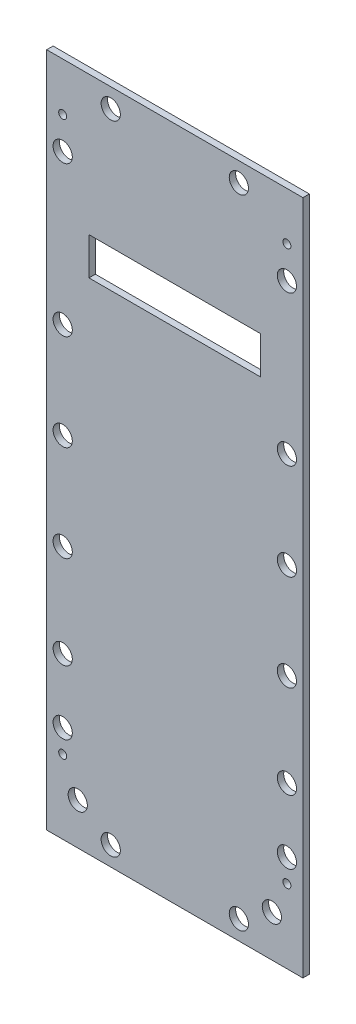
ISO-10303-21;
HEADER;
FILE_DESCRIPTION(('STEP AP214'),'2;1');
FILE_NAME('part.step','',(''),(''),'','','');
FILE_SCHEMA(('AUTOMOTIVE_DESIGN { 1 0 10303 214 1 1 1 1 }'));
ENDSEC;
DATA;
#1=APPLICATION_CONTEXT('core data for automotive mechanical design processes');
#2=APPLICATION_PROTOCOL_DEFINITION('international standard','automotive_design',2000,#1);
#3=PRODUCT_CONTEXT('',#1,'mechanical');
#4=PRODUCT('Part','Part','',(#3));
#5=PRODUCT_RELATED_PRODUCT_CATEGORY('part','',(#4));
#6=PRODUCT_DEFINITION_FORMATION('','',#4);
#7=PRODUCT_DEFINITION_CONTEXT('part definition',#1,'design');
#8=PRODUCT_DEFINITION('design','',#6,#7);
#9=PRODUCT_DEFINITION_SHAPE('','',#8);
#10=(LENGTH_UNIT() NAMED_UNIT(*) SI_UNIT(.MILLI.,.METRE.));
#11=(NAMED_UNIT(*) PLANE_ANGLE_UNIT() SI_UNIT($,.RADIAN.));
#12=(NAMED_UNIT(*) SI_UNIT($,.STERADIAN.) SOLID_ANGLE_UNIT());
#13=UNCERTAINTY_MEASURE_WITH_UNIT(LENGTH_MEASURE(1.E-05),#10,'distance_accuracy_value','');
#14=(GEOMETRIC_REPRESENTATION_CONTEXT(3) GLOBAL_UNCERTAINTY_ASSIGNED_CONTEXT((#13)) GLOBAL_UNIT_ASSIGNED_CONTEXT((#10,
#11,#12)) REPRESENTATION_CONTEXT('',''));
#15=CARTESIAN_POINT('',(0.,0.,0.));
#16=DIRECTION('',(0.,0.,1.));
#17=DIRECTION('',(1.,0.,0.));
#18=AXIS2_PLACEMENT_3D('',#15,#16,#17);
#19=CARTESIAN_POINT('',(0.,0.,2.));
#20=DIRECTION('',(0.,0.,-1.));
#21=DIRECTION('',(-1.,0.,0.));
#22=AXIS2_PLACEMENT_3D('',#19,#20,#21);
#23=PLANE('',#22);
#24=CARTESIAN_POINT('',(20.,205.,2.));
#25=DIRECTION('',(0.,0.,-1.));
#26=DIRECTION('',(-1.,0.,0.));
#27=AXIS2_PLACEMENT_3D('',#24,#25,#26);
#28=CIRCLE('',#27,3.);
#29=CARTESIAN_POINT('',(17.,205.,2.));
#30=VERTEX_POINT('',#29);
#31=EDGE_CURVE('E386',#30,#30,#28,.F.);
#32=ORIENTED_EDGE('',*,*,#31,.F.);
#33=EDGE_LOOP('',(#32));
#34=FACE_BOUND('',#33,.T.);
#35=CARTESIAN_POINT('',(5.00000000000001,30.2,2.));
#36=DIRECTION('',(0.,0.,-1.));
#37=DIRECTION('',(-1.,0.,0.));
#38=AXIS2_PLACEMENT_3D('',#35,#36,#37);
#39=CIRCLE('',#38,3.);
#40=CARTESIAN_POINT('',(2.00000000000001,30.2,2.));
#41=VERTEX_POINT('',#40);
#42=EDGE_CURVE('E385',#41,#41,#39,.F.);
#43=ORIENTED_EDGE('',*,*,#42,.F.);
#44=EDGE_LOOP('',(#43));
#45=FACE_BOUND('',#44,.T.);
#46=CARTESIAN_POINT('',(5.00000000000001,50.2,2.));
#47=DIRECTION('',(0.,0.,-1.));
#48=DIRECTION('',(-1.,0.,0.));
#49=AXIS2_PLACEMENT_3D('',#46,#47,#48);
#50=CIRCLE('',#49,3.);
#51=CARTESIAN_POINT('',(2.00000000000001,50.2,2.));
#52=VERTEX_POINT('',#51);
#53=EDGE_CURVE('E402',#52,#52,#50,.F.);
#54=ORIENTED_EDGE('',*,*,#53,.F.);
#55=EDGE_LOOP('',(#54));
#56=FACE_BOUND('',#55,.T.);
#57=CARTESIAN_POINT('',(5.00000000000002,79.2,2.));
#58=DIRECTION('',(0.,0.,-1.));
#59=DIRECTION('',(-1.,0.,0.));
#60=AXIS2_PLACEMENT_3D('',#57,#58,#59);
#61=CIRCLE('',#60,3.);
#62=CARTESIAN_POINT('',(2.00000000000001,79.2,2.));
#63=VERTEX_POINT('',#62);
#64=EDGE_CURVE('E401',#63,#63,#61,.F.);
#65=ORIENTED_EDGE('',*,*,#64,.F.);
#66=EDGE_LOOP('',(#65));
#67=FACE_BOUND('',#66,.T.);
#68=CARTESIAN_POINT('',(60.,5.99999999999999,2.));
#69=DIRECTION('',(0.,0.,-1.));
#70=DIRECTION('',(-1.,0.,0.));
#71=AXIS2_PLACEMENT_3D('',#68,#69,#70);
#72=CIRCLE('',#71,3.);
#73=CARTESIAN_POINT('',(57.,5.99999999999999,2.));
#74=VERTEX_POINT('',#73);
#75=EDGE_CURVE('E353',#74,#74,#72,.F.);
#76=ORIENTED_EDGE('',*,*,#75,.F.);
#77=EDGE_LOOP('',(#76));
#78=FACE_BOUND('',#77,.T.);
#79=CARTESIAN_POINT('',(20.,5.99999999999999,2.));
#80=DIRECTION('',(0.,0.,-1.));
#81=DIRECTION('',(-1.,0.,0.));
#82=AXIS2_PLACEMENT_3D('',#79,#80,#81);
#83=CIRCLE('',#82,2.99999999999999);
#84=CARTESIAN_POINT('',(17.,5.99999999999999,2.));
#85=VERTEX_POINT('',#84);
#86=EDGE_CURVE('E354',#85,#85,#83,.F.);
#87=ORIENTED_EDGE('',*,*,#86,.F.);
#88=EDGE_LOOP('',(#87));
#89=FACE_BOUND('',#88,.T.);
#90=CARTESIAN_POINT('',(70.3,13.,2.));
#91=DIRECTION('',(0.,0.,-1.));
#92=DIRECTION('',(-1.,0.,0.));
#93=AXIS2_PLACEMENT_3D('',#90,#91,#92);
#94=CIRCLE('',#93,3.00000000000001);
#95=CARTESIAN_POINT('',(67.3,13.,2.));
#96=VERTEX_POINT('',#95);
#97=EDGE_CURVE('E363',#96,#96,#94,.F.);
#98=ORIENTED_EDGE('',*,*,#97,.F.);
#99=EDGE_LOOP('',(#98));
#100=FACE_BOUND('',#99,.T.);
#101=CARTESIAN_POINT('',(60.,205.,2.));
#102=DIRECTION('',(0.,0.,-1.));
#103=DIRECTION('',(-1.,0.,0.));
#104=AXIS2_PLACEMENT_3D('',#101,#102,#103);
#105=CIRCLE('',#104,3.);
#106=CARTESIAN_POINT('',(57.,205.,2.));
#107=VERTEX_POINT('',#106);
#108=EDGE_CURVE('E371',#107,#107,#105,.F.);
#109=ORIENTED_EDGE('',*,*,#108,.F.);
#110=EDGE_LOOP('',(#109));
#111=FACE_BOUND('',#110,.T.);
#112=CARTESIAN_POINT('',(75.,139.2,2.));
#113=DIRECTION('',(0.,0.,-1.));
#114=DIRECTION('',(-1.,0.,0.));
#115=AXIS2_PLACEMENT_3D('',#112,#113,#114);
#116=CIRCLE('',#115,3.00000000000001);
#117=CARTESIAN_POINT('',(72.,139.2,2.));
#118=VERTEX_POINT('',#117);
#119=EDGE_CURVE('E449',#118,#118,#116,.F.);
#120=ORIENTED_EDGE('',*,*,#119,.F.);
#121=EDGE_LOOP('',(#120));
#122=FACE_BOUND('',#121,.T.);
#123=CARTESIAN_POINT('',(75.,109.2,2.));
#124=DIRECTION('',(0.,0.,-1.));
#125=DIRECTION('',(-1.,0.,0.));
#126=AXIS2_PLACEMENT_3D('',#123,#124,#125);
#127=CIRCLE('',#126,3.00000000000001);
#128=CARTESIAN_POINT('',(72.,109.2,2.));
#129=VERTEX_POINT('',#128);
#130=EDGE_CURVE('E450',#129,#129,#127,.F.);
#131=ORIENTED_EDGE('',*,*,#130,.F.);
#132=EDGE_LOOP('',(#131));
#133=FACE_BOUND('',#132,.T.);
#134=CARTESIAN_POINT('',(75.,79.2,2.));
#135=DIRECTION('',(0.,0.,-1.));
#136=DIRECTION('',(-1.,0.,0.));
#137=AXIS2_PLACEMENT_3D('',#134,#135,#136);
#138=CIRCLE('',#137,3.00000000000001);
#139=CARTESIAN_POINT('',(72.,79.2,2.));
#140=VERTEX_POINT('',#139);
#141=EDGE_CURVE('E459',#140,#140,#138,.F.);
#142=ORIENTED_EDGE('',*,*,#141,.F.);
#143=EDGE_LOOP('',(#142));
#144=FACE_BOUND('',#143,.T.);
#145=CARTESIAN_POINT('',(75.,50.2,2.));
#146=DIRECTION('',(0.,0.,-1.));
#147=DIRECTION('',(-1.,0.,0.));
#148=AXIS2_PLACEMENT_3D('',#145,#146,#147);
#149=CIRCLE('',#148,3.00000000000001);
#150=CARTESIAN_POINT('',(72.,50.2,2.));
#151=VERTEX_POINT('',#150);
#152=EDGE_CURVE('E467',#151,#151,#149,.F.);
#153=ORIENTED_EDGE('',*,*,#152,.F.);
#154=EDGE_LOOP('',(#153));
#155=FACE_BOUND('',#154,.T.);
#156=CARTESIAN_POINT('',(5.00000000000002,109.2,2.));
#157=DIRECTION('',(0.,0.,-1.));
#158=DIRECTION('',(-1.,0.,0.));
#159=AXIS2_PLACEMENT_3D('',#156,#157,#158);
#160=CIRCLE('',#159,3.);
#161=CARTESIAN_POINT('',(2.00000000000002,109.2,2.));
#162=VERTEX_POINT('',#161);
#163=EDGE_CURVE('E418',#162,#162,#160,.F.);
#164=ORIENTED_EDGE('',*,*,#163,.F.);
#165=EDGE_LOOP('',(#164));
#166=FACE_BOUND('',#165,.T.);
#167=CARTESIAN_POINT('',(5.00000000000002,139.2,2.));
#168=DIRECTION('',(0.,0.,-1.));
#169=DIRECTION('',(-1.,0.,0.));
#170=AXIS2_PLACEMENT_3D('',#167,#168,#169);
#171=CIRCLE('',#170,3.);
#172=CARTESIAN_POINT('',(2.00000000000002,139.2,2.));
#173=VERTEX_POINT('',#172);
#174=EDGE_CURVE('E417',#173,#173,#171,.F.);
#175=ORIENTED_EDGE('',*,*,#174,.F.);
#176=EDGE_LOOP('',(#175));
#177=FACE_BOUND('',#176,.T.);
#178=CARTESIAN_POINT('',(5.00000000000003,186.,2.));
#179=DIRECTION('',(0.,0.,-1.));
#180=DIRECTION('',(-1.,0.,0.));
#181=AXIS2_PLACEMENT_3D('',#178,#179,#180);
#182=CIRCLE('',#181,3.);
#183=CARTESIAN_POINT('',(2.00000000000003,186.,2.));
#184=VERTEX_POINT('',#183);
#185=EDGE_CURVE('E434',#184,#184,#182,.F.);
#186=ORIENTED_EDGE('',*,*,#185,.F.);
#187=EDGE_LOOP('',(#186));
#188=FACE_BOUND('',#187,.T.);
#189=CARTESIAN_POINT('',(75.,30.2,2.));
#190=DIRECTION('',(0.,0.,-1.));
#191=DIRECTION('',(-1.,0.,0.));
#192=AXIS2_PLACEMENT_3D('',#189,#190,#191);
#193=CIRCLE('',#192,3.00000000000001);
#194=CARTESIAN_POINT('',(72.,30.2,2.));
#195=VERTEX_POINT('',#194);
#196=EDGE_CURVE('E433',#195,#195,#193,.F.);
#197=ORIENTED_EDGE('',*,*,#196,.F.);
#198=EDGE_LOOP('',(#197));
#199=FACE_BOUND('',#198,.T.);
#200=CARTESIAN_POINT('',(9.7,13.,2.));
#201=DIRECTION('',(0.,0.,-1.));
#202=DIRECTION('',(-1.,0.,0.));
#203=AXIS2_PLACEMENT_3D('',#200,#201,#202);
#204=CIRCLE('',#203,3.);
#205=CARTESIAN_POINT('',(6.7,13.,2.));
#206=VERTEX_POINT('',#205);
#207=EDGE_CURVE('E338',#206,#206,#204,.F.);
#208=ORIENTED_EDGE('',*,*,#207,.F.);
#209=EDGE_LOOP('',(#208));
#210=FACE_BOUND('',#209,.T.);
#211=CARTESIAN_POINT('',(75.,186.,2.));
#212=DIRECTION('',(0.,0.,-1.));
#213=DIRECTION('',(-1.,0.,0.));
#214=AXIS2_PLACEMENT_3D('',#211,#212,#213);
#215=CIRCLE('',#214,3.00000000000001);
#216=CARTESIAN_POINT('',(72.,186.,2.));
#217=VERTEX_POINT('',#216);
#218=EDGE_CURVE('E480',#217,#217,#215,.F.);
#219=ORIENTED_EDGE('',*,*,#218,.F.);
#220=EDGE_LOOP('',(#219));
#221=FACE_BOUND('',#220,.T.);
#222=CARTESIAN_POINT('',(75.,196.,2.));
#223=DIRECTION('',(0.,0.,-1.));
#224=DIRECTION('',(-1.,0.,0.));
#225=AXIS2_PLACEMENT_3D('',#222,#223,#224);
#226=CIRCLE('',#225,1.25);
#227=CARTESIAN_POINT('',(73.75,196.,2.));
#228=VERTEX_POINT('',#227);
#229=EDGE_CURVE('E488',#228,#228,#226,.T.);
#230=ORIENTED_EDGE('',*,*,#229,.T.);
#231=EDGE_LOOP('',(#230));
#232=FACE_BOUND('',#231,.T.);
#233=CARTESIAN_POINT('',(5.00000000000003,196.,2.));
#234=DIRECTION('',(0.,0.,-1.));
#235=DIRECTION('',(-1.,0.,0.));
#236=AXIS2_PLACEMENT_3D('',#233,#234,#235);
#237=CIRCLE('',#236,1.25);
#238=CARTESIAN_POINT('',(3.75000000000003,196.,2.));
#239=VERTEX_POINT('',#238);
#240=EDGE_CURVE('E496',#239,#239,#237,.T.);
#241=ORIENTED_EDGE('',*,*,#240,.T.);
#242=EDGE_LOOP('',(#241));
#243=FACE_BOUND('',#242,.T.);
#244=CARTESIAN_POINT('',(75.,23.,2.));
#245=DIRECTION('',(0.,0.,-1.));
#246=DIRECTION('',(-1.,0.,0.));
#247=AXIS2_PLACEMENT_3D('',#244,#245,#246);
#248=CIRCLE('',#247,1.25);
#249=CARTESIAN_POINT('',(73.75,23.,2.));
#250=VERTEX_POINT('',#249);
#251=EDGE_CURVE('E504',#250,#250,#248,.T.);
#252=ORIENTED_EDGE('',*,*,#251,.T.);
#253=EDGE_LOOP('',(#252));
#254=FACE_BOUND('',#253,.T.);
#255=CARTESIAN_POINT('',(5.00000000000003,23.,2.));
#256=DIRECTION('',(0.,0.,-1.));
#257=DIRECTION('',(-1.,0.,0.));
#258=AXIS2_PLACEMENT_3D('',#255,#256,#257);
#259=CIRCLE('',#258,1.25);
#260=CARTESIAN_POINT('',(3.75000000000003,23.,2.));
#261=VERTEX_POINT('',#260);
#262=EDGE_CURVE('E139',#261,#261,#259,.T.);
#263=ORIENTED_EDGE('',*,*,#262,.T.);
#264=EDGE_LOOP('',(#263));
#265=FACE_BOUND('',#264,.T.);
#266=DIRECTION('',(1.,0.,0.));
#267=VECTOR('',#266,1.);
#268=CARTESIAN_POINT('',(80.,0.,2.));
#269=LINE('',#268,#267);
#270=CARTESIAN_POINT('',(0.,0.,2.));
#271=VERTEX_POINT('',#270);
#272=CARTESIAN_POINT('',(80.,0.,2.));
#273=VERTEX_POINT('',#272);
#274=EDGE_CURVE('E155',#271,#273,#269,.T.);
#275=ORIENTED_EDGE('',*,*,#274,.T.);
#276=DIRECTION('',(0.,1.,0.));
#277=VECTOR('',#276,1.);
#278=CARTESIAN_POINT('',(80.,211.,2.));
#279=LINE('',#278,#277);
#280=CARTESIAN_POINT('',(80.,211.,2.));
#281=VERTEX_POINT('',#280);
#282=EDGE_CURVE('E159',#273,#281,#279,.T.);
#283=ORIENTED_EDGE('',*,*,#282,.T.);
#284=DIRECTION('',(-1.,0.,0.));
#285=VECTOR('',#284,1.);
#286=CARTESIAN_POINT('',(0.,211.,2.));
#287=LINE('',#286,#285);
#288=CARTESIAN_POINT('',(0.,211.,2.));
#289=VERTEX_POINT('',#288);
#290=EDGE_CURVE('E163',#281,#289,#287,.T.);
#291=ORIENTED_EDGE('',*,*,#290,.T.);
#292=DIRECTION('',(0.,-1.,0.));
#293=VECTOR('',#292,1.);
#294=CARTESIAN_POINT('',(0.,0.,2.));
#295=LINE('',#294,#293);
#296=EDGE_CURVE('E166',#289,#271,#295,.T.);
#297=ORIENTED_EDGE('',*,*,#296,.T.);
#298=EDGE_LOOP('',(#275,#283,#291,#297));
#299=FACE_BOUND('',#298,.T.);
#300=DIRECTION('',(1.,0.,0.));
#301=VECTOR('',#300,1.);
#302=CARTESIAN_POINT('',(13.2,155.9,2.));
#303=LINE('',#302,#301);
#304=CARTESIAN_POINT('',(13.2,155.9,2.));
#305=VERTEX_POINT('',#304);
#306=CARTESIAN_POINT('',(66.8,155.9,2.));
#307=VERTEX_POINT('',#306);
#308=EDGE_CURVE('E105',#305,#307,#303,.T.);
#309=ORIENTED_EDGE('',*,*,#308,.F.);
#310=DIRECTION('',(0.,-1.,0.));
#311=VECTOR('',#310,1.);
#312=CARTESIAN_POINT('',(13.2,167.6,2.));
#313=LINE('',#312,#311);
#314=CARTESIAN_POINT('',(13.2,167.6,2.));
#315=VERTEX_POINT('',#314);
#316=EDGE_CURVE('E131',#315,#305,#313,.T.);
#317=ORIENTED_EDGE('',*,*,#316,.F.);
#318=DIRECTION('',(-1.,0.,0.));
#319=VECTOR('',#318,1.);
#320=CARTESIAN_POINT('',(66.8,167.6,2.));
#321=LINE('',#320,#319);
#322=CARTESIAN_POINT('',(66.8,167.6,2.));
#323=VERTEX_POINT('',#322);
#324=EDGE_CURVE('E127',#323,#315,#321,.T.);
#325=ORIENTED_EDGE('',*,*,#324,.F.);
#326=DIRECTION('',(0.,1.,0.));
#327=VECTOR('',#326,1.);
#328=CARTESIAN_POINT('',(66.8,167.6,2.));
#329=LINE('',#328,#327);
#330=EDGE_CURVE('E114',#307,#323,#329,.T.);
#331=ORIENTED_EDGE('',*,*,#330,.F.);
#332=EDGE_LOOP('',(#309,#317,#325,#331));
#333=FACE_BOUND('',#332,.T.);
#334=ADVANCED_FACE('F39',(#34,#45,#56,#67,#78,#89,#100,#111,#122,#133,#144,#155,#166,#177,#188,
#199,#210,#221,#232,#243,#254,#265,#299,#333),#23,.F.);
#335=CARTESIAN_POINT('',(0.,0.,0.));
#336=DIRECTION('',(0.,0.,-1.));
#337=DIRECTION('',(-1.,0.,0.));
#338=AXIS2_PLACEMENT_3D('',#335,#336,#337);
#339=PLANE('',#338);
#340=CARTESIAN_POINT('',(20.,205.,0.));
#341=DIRECTION('',(0.,0.,-1.));
#342=DIRECTION('',(-1.,0.,0.));
#343=AXIS2_PLACEMENT_3D('',#340,#341,#342);
#344=CIRCLE('',#343,3.);
#345=CARTESIAN_POINT('',(17.,205.,0.));
#346=VERTEX_POINT('',#345);
#347=EDGE_CURVE('E358',#346,#346,#344,.T.);
#348=ORIENTED_EDGE('',*,*,#347,.F.);
#349=EDGE_LOOP('',(#348));
#350=FACE_BOUND('',#349,.T.);
#351=CARTESIAN_POINT('',(5.00000000000001,30.2,0.));
#352=DIRECTION('',(0.,0.,-1.));
#353=DIRECTION('',(-1.,0.,0.));
#354=AXIS2_PLACEMENT_3D('',#351,#352,#353);
#355=CIRCLE('',#354,3.);
#356=CARTESIAN_POINT('',(2.00000000000001,30.2,0.));
#357=VERTEX_POINT('',#356);
#358=EDGE_CURVE('E381',#357,#357,#355,.T.);
#359=ORIENTED_EDGE('',*,*,#358,.F.);
#360=EDGE_LOOP('',(#359));
#361=FACE_BOUND('',#360,.T.);
#362=CARTESIAN_POINT('',(5.00000000000001,50.2,0.));
#363=DIRECTION('',(0.,0.,-1.));
#364=DIRECTION('',(-1.,0.,0.));
#365=AXIS2_PLACEMENT_3D('',#362,#363,#364);
#366=CIRCLE('',#365,3.);
#367=CARTESIAN_POINT('',(2.00000000000001,50.2,0.));
#368=VERTEX_POINT('',#367);
#369=EDGE_CURVE('E390',#368,#368,#366,.T.);
#370=ORIENTED_EDGE('',*,*,#369,.F.);
#371=EDGE_LOOP('',(#370));
#372=FACE_BOUND('',#371,.T.);
#373=CARTESIAN_POINT('',(5.00000000000002,79.2,0.));
#374=DIRECTION('',(0.,0.,-1.));
#375=DIRECTION('',(-1.,0.,0.));
#376=AXIS2_PLACEMENT_3D('',#373,#374,#375);
#377=CIRCLE('',#376,3.);
#378=CARTESIAN_POINT('',(2.00000000000001,79.2,0.));
#379=VERTEX_POINT('',#378);
#380=EDGE_CURVE('E397',#379,#379,#377,.T.);
#381=ORIENTED_EDGE('',*,*,#380,.F.);
#382=EDGE_LOOP('',(#381));
#383=FACE_BOUND('',#382,.T.);
#384=CARTESIAN_POINT('',(60.,5.99999999999999,0.));
#385=DIRECTION('',(0.,0.,-1.));
#386=DIRECTION('',(-1.,0.,0.));
#387=AXIS2_PLACEMENT_3D('',#384,#385,#386);
#388=CIRCLE('',#387,3.);
#389=CARTESIAN_POINT('',(57.,5.99999999999999,0.));
#390=VERTEX_POINT('',#389);
#391=EDGE_CURVE('E349',#390,#390,#388,.T.);
#392=ORIENTED_EDGE('',*,*,#391,.F.);
#393=EDGE_LOOP('',(#392));
#394=FACE_BOUND('',#393,.T.);
#395=CARTESIAN_POINT('',(20.,5.99999999999999,0.));
#396=DIRECTION('',(0.,0.,-1.));
#397=DIRECTION('',(-1.,0.,0.));
#398=AXIS2_PLACEMENT_3D('',#395,#396,#397);
#399=CIRCLE('',#398,2.99999999999999);
#400=CARTESIAN_POINT('',(17.,5.99999999999999,0.));
#401=VERTEX_POINT('',#400);
#402=EDGE_CURVE('E359',#401,#401,#399,.T.);
#403=ORIENTED_EDGE('',*,*,#402,.F.);
#404=EDGE_LOOP('',(#403));
#405=FACE_BOUND('',#404,.T.);
#406=CARTESIAN_POINT('',(70.3,13.,0.));
#407=DIRECTION('',(0.,0.,-1.));
#408=DIRECTION('',(-1.,0.,0.));
#409=AXIS2_PLACEMENT_3D('',#406,#407,#408);
#410=CIRCLE('',#409,3.00000000000001);
#411=CARTESIAN_POINT('',(67.3,13.,0.));
#412=VERTEX_POINT('',#411);
#413=EDGE_CURVE('E367',#412,#412,#410,.T.);
#414=ORIENTED_EDGE('',*,*,#413,.F.);
#415=EDGE_LOOP('',(#414));
#416=FACE_BOUND('',#415,.T.);
#417=CARTESIAN_POINT('',(60.,205.,0.));
#418=DIRECTION('',(0.,0.,-1.));
#419=DIRECTION('',(-1.,0.,0.));
#420=AXIS2_PLACEMENT_3D('',#417,#418,#419);
#421=CIRCLE('',#420,3.);
#422=CARTESIAN_POINT('',(57.,205.,0.));
#423=VERTEX_POINT('',#422);
#424=EDGE_CURVE('E346',#423,#423,#421,.T.);
#425=ORIENTED_EDGE('',*,*,#424,.F.);
#426=EDGE_LOOP('',(#425));
#427=FACE_BOUND('',#426,.T.);
#428=CARTESIAN_POINT('',(75.,139.2,0.));
#429=DIRECTION('',(0.,0.,-1.));
#430=DIRECTION('',(-1.,0.,0.));
#431=AXIS2_PLACEMENT_3D('',#428,#429,#430);
#432=CIRCLE('',#431,3.00000000000001);
#433=CARTESIAN_POINT('',(72.,139.2,0.));
#434=VERTEX_POINT('',#433);
#435=EDGE_CURVE('E445',#434,#434,#432,.T.);
#436=ORIENTED_EDGE('',*,*,#435,.F.);
#437=EDGE_LOOP('',(#436));
#438=FACE_BOUND('',#437,.T.);
#439=CARTESIAN_POINT('',(75.,109.2,0.));
#440=DIRECTION('',(0.,0.,-1.));
#441=DIRECTION('',(-1.,0.,0.));
#442=AXIS2_PLACEMENT_3D('',#439,#440,#441);
#443=CIRCLE('',#442,3.00000000000001);
#444=CARTESIAN_POINT('',(72.,109.2,0.));
#445=VERTEX_POINT('',#444);
#446=EDGE_CURVE('E455',#445,#445,#443,.T.);
#447=ORIENTED_EDGE('',*,*,#446,.F.);
#448=EDGE_LOOP('',(#447));
#449=FACE_BOUND('',#448,.T.);
#450=CARTESIAN_POINT('',(75.,79.2,0.));
#451=DIRECTION('',(0.,0.,-1.));
#452=DIRECTION('',(-1.,0.,0.));
#453=AXIS2_PLACEMENT_3D('',#450,#451,#452);
#454=CIRCLE('',#453,3.00000000000001);
#455=CARTESIAN_POINT('',(72.,79.2,0.));
#456=VERTEX_POINT('',#455);
#457=EDGE_CURVE('E463',#456,#456,#454,.T.);
#458=ORIENTED_EDGE('',*,*,#457,.F.);
#459=EDGE_LOOP('',(#458));
#460=FACE_BOUND('',#459,.T.);
#461=CARTESIAN_POINT('',(75.,50.2,0.));
#462=DIRECTION('',(0.,0.,-1.));
#463=DIRECTION('',(-1.,0.,0.));
#464=AXIS2_PLACEMENT_3D('',#461,#462,#463);
#465=CIRCLE('',#464,3.00000000000001);
#466=CARTESIAN_POINT('',(72.,50.2,0.));
#467=VERTEX_POINT('',#466);
#468=EDGE_CURVE('E438',#467,#467,#465,.T.);
#469=ORIENTED_EDGE('',*,*,#468,.F.);
#470=EDGE_LOOP('',(#469));
#471=FACE_BOUND('',#470,.T.);
#472=CARTESIAN_POINT('',(5.00000000000002,109.2,0.));
#473=DIRECTION('',(0.,0.,-1.));
#474=DIRECTION('',(-1.,0.,0.));
#475=AXIS2_PLACEMENT_3D('',#472,#473,#474);
#476=CIRCLE('',#475,3.);
#477=CARTESIAN_POINT('',(2.00000000000002,109.2,0.));
#478=VERTEX_POINT('',#477);
#479=EDGE_CURVE('E406',#478,#478,#476,.T.);
#480=ORIENTED_EDGE('',*,*,#479,.F.);
#481=EDGE_LOOP('',(#480));
#482=FACE_BOUND('',#481,.T.);
#483=CARTESIAN_POINT('',(5.00000000000002,139.2,0.));
#484=DIRECTION('',(0.,0.,-1.));
#485=DIRECTION('',(-1.,0.,0.));
#486=AXIS2_PLACEMENT_3D('',#483,#484,#485);
#487=CIRCLE('',#486,3.);
#488=CARTESIAN_POINT('',(2.00000000000002,139.2,0.));
#489=VERTEX_POINT('',#488);
#490=EDGE_CURVE('E413',#489,#489,#487,.T.);
#491=ORIENTED_EDGE('',*,*,#490,.F.);
#492=EDGE_LOOP('',(#491));
#493=FACE_BOUND('',#492,.T.);
#494=CARTESIAN_POINT('',(5.00000000000003,186.,0.));
#495=DIRECTION('',(0.,0.,-1.));
#496=DIRECTION('',(-1.,0.,0.));
#497=AXIS2_PLACEMENT_3D('',#494,#495,#496);
#498=CIRCLE('',#497,3.);
#499=CARTESIAN_POINT('',(2.00000000000003,186.,0.));
#500=VERTEX_POINT('',#499);
#501=EDGE_CURVE('E422',#500,#500,#498,.T.);
#502=ORIENTED_EDGE('',*,*,#501,.F.);
#503=EDGE_LOOP('',(#502));
#504=FACE_BOUND('',#503,.T.);
#505=CARTESIAN_POINT('',(75.,30.2,0.));
#506=DIRECTION('',(0.,0.,-1.));
#507=DIRECTION('',(-1.,0.,0.));
#508=AXIS2_PLACEMENT_3D('',#505,#506,#507);
#509=CIRCLE('',#508,3.00000000000001);
#510=CARTESIAN_POINT('',(72.,30.2,0.));
#511=VERTEX_POINT('',#510);
#512=EDGE_CURVE('E429',#511,#511,#509,.T.);
#513=ORIENTED_EDGE('',*,*,#512,.F.);
#514=EDGE_LOOP('',(#513));
#515=FACE_BOUND('',#514,.T.);
#516=CARTESIAN_POINT('',(9.7,13.,0.));
#517=DIRECTION('',(0.,0.,-1.));
#518=DIRECTION('',(-1.,0.,0.));
#519=AXIS2_PLACEMENT_3D('',#516,#517,#518);
#520=CIRCLE('',#519,3.);
#521=CARTESIAN_POINT('',(6.7,13.,0.));
#522=VERTEX_POINT('',#521);
#523=EDGE_CURVE('E341',#522,#522,#520,.T.);
#524=ORIENTED_EDGE('',*,*,#523,.F.);
#525=EDGE_LOOP('',(#524));
#526=FACE_BOUND('',#525,.T.);
#527=CARTESIAN_POINT('',(75.,186.,0.));
#528=DIRECTION('',(0.,0.,-1.));
#529=DIRECTION('',(-1.,0.,0.));
#530=AXIS2_PLACEMENT_3D('',#527,#528,#529);
#531=CIRCLE('',#530,3.00000000000001);
#532=CARTESIAN_POINT('',(72.,186.,0.));
#533=VERTEX_POINT('',#532);
#534=EDGE_CURVE('E454',#533,#533,#531,.T.);
#535=ORIENTED_EDGE('',*,*,#534,.F.);
#536=EDGE_LOOP('',(#535));
#537=FACE_BOUND('',#536,.T.);
#538=CARTESIAN_POINT('',(75.,196.,0.));
#539=DIRECTION('',(0.,0.,-1.));
#540=DIRECTION('',(-1.,0.,0.));
#541=AXIS2_PLACEMENT_3D('',#538,#539,#540);
#542=CIRCLE('',#541,1.25);
#543=CARTESIAN_POINT('',(73.75,196.,0.));
#544=VERTEX_POINT('',#543);
#545=EDGE_CURVE('E484',#544,#544,#542,.T.);
#546=ORIENTED_EDGE('',*,*,#545,.F.);
#547=EDGE_LOOP('',(#546));
#548=FACE_BOUND('',#547,.T.);
#549=CARTESIAN_POINT('',(5.00000000000003,196.,0.));
#550=DIRECTION('',(0.,0.,-1.));
#551=DIRECTION('',(-1.,0.,0.));
#552=AXIS2_PLACEMENT_3D('',#549,#550,#551);
#553=CIRCLE('',#552,1.25);
#554=CARTESIAN_POINT('',(3.75000000000003,196.,0.));
#555=VERTEX_POINT('',#554);
#556=EDGE_CURVE('E492',#555,#555,#553,.T.);
#557=ORIENTED_EDGE('',*,*,#556,.F.);
#558=EDGE_LOOP('',(#557));
#559=FACE_BOUND('',#558,.T.);
#560=CARTESIAN_POINT('',(75.,23.,0.));
#561=DIRECTION('',(0.,0.,-1.));
#562=DIRECTION('',(-1.,0.,0.));
#563=AXIS2_PLACEMENT_3D('',#560,#561,#562);
#564=CIRCLE('',#563,1.25);
#565=CARTESIAN_POINT('',(73.75,23.,0.));
#566=VERTEX_POINT('',#565);
#567=EDGE_CURVE('E500',#566,#566,#564,.T.);
#568=ORIENTED_EDGE('',*,*,#567,.F.);
#569=EDGE_LOOP('',(#568));
#570=FACE_BOUND('',#569,.T.);
#571=CARTESIAN_POINT('',(5.00000000000003,23.,0.));
#572=DIRECTION('',(0.,0.,-1.));
#573=DIRECTION('',(-1.,0.,0.));
#574=AXIS2_PLACEMENT_3D('',#571,#572,#573);
#575=CIRCLE('',#574,1.25);
#576=CARTESIAN_POINT('',(3.75000000000003,23.,0.));
#577=VERTEX_POINT('',#576);
#578=EDGE_CURVE('E508',#577,#577,#575,.T.);
#579=ORIENTED_EDGE('',*,*,#578,.F.);
#580=EDGE_LOOP('',(#579));
#581=FACE_BOUND('',#580,.T.);
#582=DIRECTION('',(1.,0.,0.));
#583=VECTOR('',#582,1.);
#584=CARTESIAN_POINT('',(80.,0.,0.));
#585=LINE('',#584,#583);
#586=CARTESIAN_POINT('',(0.,0.,0.));
#587=VERTEX_POINT('',#586);
#588=CARTESIAN_POINT('',(80.,0.,0.));
#589=VERTEX_POINT('',#588);
#590=EDGE_CURVE('E123',#587,#589,#585,.T.);
#591=ORIENTED_EDGE('',*,*,#590,.F.);
#592=DIRECTION('',(0.,-1.,0.));
#593=VECTOR('',#592,1.);
#594=CARTESIAN_POINT('',(0.,0.,0.));
#595=LINE('',#594,#593);
#596=CARTESIAN_POINT('',(0.,211.,0.));
#597=VERTEX_POINT('',#596);
#598=EDGE_CURVE('E160',#597,#587,#595,.T.);
#599=ORIENTED_EDGE('',*,*,#598,.F.);
#600=DIRECTION('',(-1.,0.,0.));
#601=VECTOR('',#600,1.);
#602=CARTESIAN_POINT('',(0.,211.,0.));
#603=LINE('',#602,#601);
#604=CARTESIAN_POINT('',(80.,211.,0.));
#605=VERTEX_POINT('',#604);
#606=EDGE_CURVE('E176',#605,#597,#603,.T.);
#607=ORIENTED_EDGE('',*,*,#606,.F.);
#608=DIRECTION('',(0.,1.,0.));
#609=VECTOR('',#608,1.);
#610=CARTESIAN_POINT('',(80.,211.,0.));
#611=LINE('',#610,#609);
#612=EDGE_CURVE('E173',#589,#605,#611,.T.);
#613=ORIENTED_EDGE('',*,*,#612,.F.);
#614=EDGE_LOOP('',(#591,#599,#607,#613));
#615=FACE_BOUND('',#614,.T.);
#616=DIRECTION('',(0.,-1.,0.));
#617=VECTOR('',#616,1.);
#618=CARTESIAN_POINT('',(13.2,167.6,0.));
#619=LINE('',#618,#617);
#620=CARTESIAN_POINT('',(13.2,167.6,0.));
#621=VERTEX_POINT('',#620);
#622=CARTESIAN_POINT('',(13.2,155.9,0.));
#623=VERTEX_POINT('',#622);
#624=EDGE_CURVE('E115',#621,#623,#619,.T.);
#625=ORIENTED_EDGE('',*,*,#624,.T.);
#626=DIRECTION('',(1.,0.,0.));
#627=VECTOR('',#626,1.);
#628=CARTESIAN_POINT('',(13.2,155.9,0.));
#629=LINE('',#628,#627);
#630=CARTESIAN_POINT('',(66.8,155.9,0.));
#631=VERTEX_POINT('',#630);
#632=EDGE_CURVE('E63',#623,#631,#629,.T.);
#633=ORIENTED_EDGE('',*,*,#632,.T.);
#634=DIRECTION('',(0.,1.,0.));
#635=VECTOR('',#634,1.);
#636=CARTESIAN_POINT('',(66.8,167.6,0.));
#637=LINE('',#636,#635);
#638=CARTESIAN_POINT('',(66.8,167.6,0.));
#639=VERTEX_POINT('',#638);
#640=EDGE_CURVE('E121',#631,#639,#637,.T.);
#641=ORIENTED_EDGE('',*,*,#640,.T.);
#642=DIRECTION('',(-1.,0.,0.));
#643=VECTOR('',#642,1.);
#644=CARTESIAN_POINT('',(66.8,167.6,0.));
#645=LINE('',#644,#643);
#646=EDGE_CURVE('E142',#639,#621,#645,.T.);
#647=ORIENTED_EDGE('',*,*,#646,.T.);
#648=EDGE_LOOP('',(#625,#633,#641,#647));
#649=FACE_BOUND('',#648,.T.);
#650=ADVANCED_FACE('F199',(#350,#361,#372,#383,#394,#405,#416,#427,#438,#449,#460,#471,#482,
#493,#504,#515,#526,#537,#548,#559,#570,#581,#615,#649),#339,.T.);
#651=CARTESIAN_POINT('',(80.,0.,2.));
#652=DIRECTION('',(0.,1.,0.));
#653=DIRECTION('',(0.,0.,1.));
#654=AXIS2_PLACEMENT_3D('',#651,#652,#653);
#655=PLANE('',#654);
#656=ORIENTED_EDGE('',*,*,#590,.T.);
#657=DIRECTION('',(0.,0.,-1.));
#658=VECTOR('',#657,1.);
#659=CARTESIAN_POINT('',(80.,0.,2.));
#660=LINE('',#659,#658);
#661=EDGE_CURVE('E11',#273,#589,#660,.T.);
#662=ORIENTED_EDGE('',*,*,#661,.F.);
#663=ORIENTED_EDGE('',*,*,#274,.F.);
#664=DIRECTION('',(0.,0.,-1.));
#665=VECTOR('',#664,1.);
#666=CARTESIAN_POINT('',(0.,0.,2.));
#667=LINE('',#666,#665);
#668=EDGE_CURVE('E169',#271,#587,#667,.T.);
#669=ORIENTED_EDGE('',*,*,#668,.T.);
#670=EDGE_LOOP('',(#656,#662,#663,#669));
#671=FACE_BOUND('',#670,.T.);
#672=ADVANCED_FACE('F41',(#671),#655,.F.);
#673=CARTESIAN_POINT('',(80.,211.,2.));
#674=DIRECTION('',(-1.,0.,0.));
#675=DIRECTION('',(0.,0.,1.));
#676=AXIS2_PLACEMENT_3D('',#673,#674,#675);
#677=PLANE('',#676);
#678=ORIENTED_EDGE('',*,*,#612,.T.);
#679=DIRECTION('',(0.,0.,-1.));
#680=VECTOR('',#679,1.);
#681=CARTESIAN_POINT('',(80.,211.,2.));
#682=LINE('',#681,#680);
#683=EDGE_CURVE('E48',#281,#605,#682,.T.);
#684=ORIENTED_EDGE('',*,*,#683,.F.);
#685=ORIENTED_EDGE('',*,*,#282,.F.);
#686=ORIENTED_EDGE('',*,*,#661,.T.);
#687=EDGE_LOOP('',(#678,#684,#685,#686));
#688=FACE_BOUND('',#687,.T.);
#689=ADVANCED_FACE('F209',(#688),#677,.F.);
#690=CARTESIAN_POINT('',(0.,211.,2.));
#691=DIRECTION('',(0.,-1.,0.));
#692=DIRECTION('',(0.,0.,-1.));
#693=AXIS2_PLACEMENT_3D('',#690,#691,#692);
#694=PLANE('',#693);
#695=ORIENTED_EDGE('',*,*,#606,.T.);
#696=DIRECTION('',(0.,0.,-1.));
#697=VECTOR('',#696,1.);
#698=CARTESIAN_POINT('',(0.,211.,2.));
#699=LINE('',#698,#697);
#700=EDGE_CURVE('E184',#289,#597,#699,.T.);
#701=ORIENTED_EDGE('',*,*,#700,.F.);
#702=ORIENTED_EDGE('',*,*,#290,.F.);
#703=ORIENTED_EDGE('',*,*,#683,.T.);
#704=EDGE_LOOP('',(#695,#701,#702,#703));
#705=FACE_BOUND('',#704,.T.);
#706=ADVANCED_FACE('F193',(#705),#694,.F.);
#707=CARTESIAN_POINT('',(0.,0.,2.));
#708=DIRECTION('',(1.,0.,0.));
#709=DIRECTION('',(0.,0.,-1.));
#710=AXIS2_PLACEMENT_3D('',#707,#708,#709);
#711=PLANE('',#710);
#712=ORIENTED_EDGE('',*,*,#598,.T.);
#713=ORIENTED_EDGE('',*,*,#668,.F.);
#714=ORIENTED_EDGE('',*,*,#296,.F.);
#715=ORIENTED_EDGE('',*,*,#700,.T.);
#716=EDGE_LOOP('',(#712,#713,#714,#715));
#717=FACE_BOUND('',#716,.T.);
#718=ADVANCED_FACE('F203',(#717),#711,.F.);
#719=CARTESIAN_POINT('',(13.2,155.9,2.));
#720=DIRECTION('',(0.,1.,0.));
#721=DIRECTION('',(0.,0.,1.));
#722=AXIS2_PLACEMENT_3D('',#719,#720,#721);
#723=PLANE('',#722);
#724=ORIENTED_EDGE('',*,*,#632,.F.);
#725=DIRECTION('',(0.,0.,-1.));
#726=VECTOR('',#725,1.);
#727=CARTESIAN_POINT('',(13.2,155.9,2.));
#728=LINE('',#727,#726);
#729=EDGE_CURVE('E109',#305,#623,#728,.T.);
#730=ORIENTED_EDGE('',*,*,#729,.F.);
#731=ORIENTED_EDGE('',*,*,#308,.T.);
#732=DIRECTION('',(0.,0.,-1.));
#733=VECTOR('',#732,1.);
#734=CARTESIAN_POINT('',(66.8,155.9,2.));
#735=LINE('',#734,#733);
#736=EDGE_CURVE('E108',#307,#631,#735,.T.);
#737=ORIENTED_EDGE('',*,*,#736,.T.);
#738=EDGE_LOOP('',(#724,#730,#731,#737));
#739=FACE_BOUND('',#738,.T.);
#740=ADVANCED_FACE('F107',(#739),#723,.T.);
#741=CARTESIAN_POINT('',(66.8,167.6,2.));
#742=DIRECTION('',(-1.,0.,0.));
#743=DIRECTION('',(0.,0.,1.));
#744=AXIS2_PLACEMENT_3D('',#741,#742,#743);
#745=PLANE('',#744);
#746=ORIENTED_EDGE('',*,*,#640,.F.);
#747=ORIENTED_EDGE('',*,*,#736,.F.);
#748=ORIENTED_EDGE('',*,*,#330,.T.);
#749=DIRECTION('',(0.,0.,-1.));
#750=VECTOR('',#749,1.);
#751=CARTESIAN_POINT('',(66.8,167.6,2.));
#752=LINE('',#751,#750);
#753=EDGE_CURVE('E124',#323,#639,#752,.T.);
#754=ORIENTED_EDGE('',*,*,#753,.T.);
#755=EDGE_LOOP('',(#746,#747,#748,#754));
#756=FACE_BOUND('',#755,.T.);
#757=ADVANCED_FACE('F118',(#756),#745,.T.);
#758=CARTESIAN_POINT('',(66.8,167.6,2.));
#759=DIRECTION('',(0.,-1.,0.));
#760=DIRECTION('',(0.,0.,-1.));
#761=AXIS2_PLACEMENT_3D('',#758,#759,#760);
#762=PLANE('',#761);
#763=ORIENTED_EDGE('',*,*,#646,.F.);
#764=ORIENTED_EDGE('',*,*,#753,.F.);
#765=ORIENTED_EDGE('',*,*,#324,.T.);
#766=DIRECTION('',(0.,0.,-1.));
#767=VECTOR('',#766,1.);
#768=CARTESIAN_POINT('',(13.2,167.6,2.));
#769=LINE('',#768,#767);
#770=EDGE_CURVE('E55',#315,#621,#769,.T.);
#771=ORIENTED_EDGE('',*,*,#770,.T.);
#772=EDGE_LOOP('',(#763,#764,#765,#771));
#773=FACE_BOUND('',#772,.T.);
#774=ADVANCED_FACE('F236',(#773),#762,.T.);
#775=CARTESIAN_POINT('',(13.2,167.6,2.));
#776=DIRECTION('',(1.,0.,0.));
#777=DIRECTION('',(0.,0.,-1.));
#778=AXIS2_PLACEMENT_3D('',#775,#776,#777);
#779=PLANE('',#778);
#780=ORIENTED_EDGE('',*,*,#624,.F.);
#781=ORIENTED_EDGE('',*,*,#770,.F.);
#782=ORIENTED_EDGE('',*,*,#316,.T.);
#783=ORIENTED_EDGE('',*,*,#729,.T.);
#784=EDGE_LOOP('',(#780,#781,#782,#783));
#785=FACE_BOUND('',#784,.T.);
#786=ADVANCED_FACE('F240',(#785),#779,.T.);
#787=CARTESIAN_POINT('',(5.00000000000003,23.,0.));
#788=DIRECTION('',(0.,0.,-1.));
#789=DIRECTION('',(-1.,0.,0.));
#790=AXIS2_PLACEMENT_3D('',#787,#788,#789);
#791=CYLINDRICAL_SURFACE('',#790,1.25);
#792=ORIENTED_EDGE('',*,*,#578,.T.);
#793=EDGE_LOOP('',(#792));
#794=FACE_BOUND('',#793,.T.);
#795=ORIENTED_EDGE('',*,*,#262,.F.);
#796=EDGE_LOOP('',(#795));
#797=FACE_BOUND('',#796,.T.);
#798=ADVANCED_FACE('F246',(#794,#797),#791,.F.);
#799=CARTESIAN_POINT('',(75.,23.,0.));
#800=DIRECTION('',(0.,0.,-1.));
#801=DIRECTION('',(-1.,0.,0.));
#802=AXIS2_PLACEMENT_3D('',#799,#800,#801);
#803=CYLINDRICAL_SURFACE('',#802,1.25);
#804=ORIENTED_EDGE('',*,*,#567,.T.);
#805=EDGE_LOOP('',(#804));
#806=FACE_BOUND('',#805,.T.);
#807=ORIENTED_EDGE('',*,*,#251,.F.);
#808=EDGE_LOOP('',(#807));
#809=FACE_BOUND('',#808,.T.);
#810=ADVANCED_FACE('F249',(#806,#809),#803,.F.);
#811=CARTESIAN_POINT('',(5.00000000000003,196.,0.));
#812=DIRECTION('',(0.,0.,-1.));
#813=DIRECTION('',(-1.,0.,0.));
#814=AXIS2_PLACEMENT_3D('',#811,#812,#813);
#815=CYLINDRICAL_SURFACE('',#814,1.25);
#816=ORIENTED_EDGE('',*,*,#556,.T.);
#817=EDGE_LOOP('',(#816));
#818=FACE_BOUND('',#817,.T.);
#819=ORIENTED_EDGE('',*,*,#240,.F.);
#820=EDGE_LOOP('',(#819));
#821=FACE_BOUND('',#820,.T.);
#822=ADVANCED_FACE('F253',(#818,#821),#815,.F.);
#823=CARTESIAN_POINT('',(75.,196.,0.));
#824=DIRECTION('',(0.,0.,-1.));
#825=DIRECTION('',(-1.,0.,0.));
#826=AXIS2_PLACEMENT_3D('',#823,#824,#825);
#827=CYLINDRICAL_SURFACE('',#826,1.25);
#828=ORIENTED_EDGE('',*,*,#545,.T.);
#829=EDGE_LOOP('',(#828));
#830=FACE_BOUND('',#829,.T.);
#831=ORIENTED_EDGE('',*,*,#229,.F.);
#832=EDGE_LOOP('',(#831));
#833=FACE_BOUND('',#832,.T.);
#834=ADVANCED_FACE('F257',(#830,#833),#827,.F.);
#835=CARTESIAN_POINT('',(75.,186.,10.4852813742386));
#836=DIRECTION('',(0.,0.,-1.));
#837=DIRECTION('',(-1.,0.,0.));
#838=AXIS2_PLACEMENT_3D('',#835,#836,#837);
#839=CYLINDRICAL_SURFACE('',#838,3.00000000000001);
#840=ORIENTED_EDGE('',*,*,#218,.T.);
#841=EDGE_LOOP('',(#840));
#842=FACE_BOUND('',#841,.T.);
#843=ORIENTED_EDGE('',*,*,#534,.T.);
#844=EDGE_LOOP('',(#843));
#845=FACE_BOUND('',#844,.T.);
#846=ADVANCED_FACE('F261',(#842,#845),#839,.F.);
#847=CARTESIAN_POINT('',(9.7,13.,10.4852813742386));
#848=DIRECTION('',(0.,0.,-1.));
#849=DIRECTION('',(-1.,0.,0.));
#850=AXIS2_PLACEMENT_3D('',#847,#848,#849);
#851=CYLINDRICAL_SURFACE('',#850,3.);
#852=ORIENTED_EDGE('',*,*,#207,.T.);
#853=EDGE_LOOP('',(#852));
#854=FACE_BOUND('',#853,.T.);
#855=ORIENTED_EDGE('',*,*,#523,.T.);
#856=EDGE_LOOP('',(#855));
#857=FACE_BOUND('',#856,.T.);
#858=ADVANCED_FACE('F265',(#854,#857),#851,.F.);
#859=CARTESIAN_POINT('',(75.,30.2,10.4852813742386));
#860=DIRECTION('',(0.,0.,-1.));
#861=DIRECTION('',(-1.,0.,0.));
#862=AXIS2_PLACEMENT_3D('',#859,#860,#861);
#863=CYLINDRICAL_SURFACE('',#862,3.00000000000001);
#864=ORIENTED_EDGE('',*,*,#196,.T.);
#865=EDGE_LOOP('',(#864));
#866=FACE_BOUND('',#865,.T.);
#867=ORIENTED_EDGE('',*,*,#512,.T.);
#868=EDGE_LOOP('',(#867));
#869=FACE_BOUND('',#868,.T.);
#870=ADVANCED_FACE('F289',(#866,#869),#863,.F.);
#871=CARTESIAN_POINT('',(5.00000000000003,186.,10.4852813742386));
#872=DIRECTION('',(0.,0.,-1.));
#873=DIRECTION('',(-1.,0.,0.));
#874=AXIS2_PLACEMENT_3D('',#871,#872,#873);
#875=CYLINDRICAL_SURFACE('',#874,3.);
#876=ORIENTED_EDGE('',*,*,#185,.T.);
#877=EDGE_LOOP('',(#876));
#878=FACE_BOUND('',#877,.T.);
#879=ORIENTED_EDGE('',*,*,#501,.T.);
#880=EDGE_LOOP('',(#879));
#881=FACE_BOUND('',#880,.T.);
#882=ADVANCED_FACE('F285',(#878,#881),#875,.F.);
#883=CARTESIAN_POINT('',(5.00000000000002,139.2,10.4852813742386));
#884=DIRECTION('',(0.,0.,-1.));
#885=DIRECTION('',(-1.,0.,0.));
#886=AXIS2_PLACEMENT_3D('',#883,#884,#885);
#887=CYLINDRICAL_SURFACE('',#886,3.);
#888=ORIENTED_EDGE('',*,*,#174,.T.);
#889=EDGE_LOOP('',(#888));
#890=FACE_BOUND('',#889,.T.);
#891=ORIENTED_EDGE('',*,*,#490,.T.);
#892=EDGE_LOOP('',(#891));
#893=FACE_BOUND('',#892,.T.);
#894=ADVANCED_FACE('F288',(#890,#893),#887,.F.);
#895=CARTESIAN_POINT('',(5.00000000000002,109.2,10.4852813742386));
#896=DIRECTION('',(0.,0.,-1.));
#897=DIRECTION('',(-1.,0.,0.));
#898=AXIS2_PLACEMENT_3D('',#895,#896,#897);
#899=CYLINDRICAL_SURFACE('',#898,3.);
#900=ORIENTED_EDGE('',*,*,#163,.T.);
#901=EDGE_LOOP('',(#900));
#902=FACE_BOUND('',#901,.T.);
#903=ORIENTED_EDGE('',*,*,#479,.T.);
#904=EDGE_LOOP('',(#903));
#905=FACE_BOUND('',#904,.T.);
#906=ADVANCED_FACE('F271',(#902,#905),#899,.F.);
#907=CARTESIAN_POINT('',(75.,50.2,10.4852813742386));
#908=DIRECTION('',(0.,0.,-1.));
#909=DIRECTION('',(-1.,0.,0.));
#910=AXIS2_PLACEMENT_3D('',#907,#908,#909);
#911=CYLINDRICAL_SURFACE('',#910,3.00000000000001);
#912=ORIENTED_EDGE('',*,*,#152,.T.);
#913=EDGE_LOOP('',(#912));
#914=FACE_BOUND('',#913,.T.);
#915=ORIENTED_EDGE('',*,*,#468,.T.);
#916=EDGE_LOOP('',(#915));
#917=FACE_BOUND('',#916,.T.);
#918=ADVANCED_FACE('F267',(#914,#917),#911,.F.);
#919=CARTESIAN_POINT('',(75.,79.2,10.4852813742386));
#920=DIRECTION('',(0.,0.,-1.));
#921=DIRECTION('',(-1.,0.,0.));
#922=AXIS2_PLACEMENT_3D('',#919,#920,#921);
#923=CYLINDRICAL_SURFACE('',#922,3.00000000000001);
#924=ORIENTED_EDGE('',*,*,#141,.T.);
#925=EDGE_LOOP('',(#924));
#926=FACE_BOUND('',#925,.T.);
#927=ORIENTED_EDGE('',*,*,#457,.T.);
#928=EDGE_LOOP('',(#927));
#929=FACE_BOUND('',#928,.T.);
#930=ADVANCED_FACE('F270',(#926,#929),#923,.F.);
#931=CARTESIAN_POINT('',(75.,109.2,10.4852813742386));
#932=DIRECTION('',(0.,0.,-1.));
#933=DIRECTION('',(-1.,0.,0.));
#934=AXIS2_PLACEMENT_3D('',#931,#932,#933);
#935=CYLINDRICAL_SURFACE('',#934,3.00000000000001);
#936=ORIENTED_EDGE('',*,*,#130,.T.);
#937=EDGE_LOOP('',(#936));
#938=FACE_BOUND('',#937,.T.);
#939=ORIENTED_EDGE('',*,*,#446,.T.);
#940=EDGE_LOOP('',(#939));
#941=FACE_BOUND('',#940,.T.);
#942=ADVANCED_FACE('F275',(#938,#941),#935,.F.);
#943=CARTESIAN_POINT('',(75.,139.2,10.4852813742386));
#944=DIRECTION('',(0.,0.,-1.));
#945=DIRECTION('',(-1.,0.,0.));
#946=AXIS2_PLACEMENT_3D('',#943,#944,#945);
#947=CYLINDRICAL_SURFACE('',#946,3.00000000000001);
#948=ORIENTED_EDGE('',*,*,#119,.T.);
#949=EDGE_LOOP('',(#948));
#950=FACE_BOUND('',#949,.T.);
#951=ORIENTED_EDGE('',*,*,#435,.T.);
#952=EDGE_LOOP('',(#951));
#953=FACE_BOUND('',#952,.T.);
#954=ADVANCED_FACE('F279',(#950,#953),#947,.F.);
#955=CARTESIAN_POINT('',(60.,205.,10.4852813742386));
#956=DIRECTION('',(0.,0.,-1.));
#957=DIRECTION('',(-1.,0.,0.));
#958=AXIS2_PLACEMENT_3D('',#955,#956,#957);
#959=CYLINDRICAL_SURFACE('',#958,3.);
#960=ORIENTED_EDGE('',*,*,#108,.T.);
#961=EDGE_LOOP('',(#960));
#962=FACE_BOUND('',#961,.T.);
#963=ORIENTED_EDGE('',*,*,#424,.T.);
#964=EDGE_LOOP('',(#963));
#965=FACE_BOUND('',#964,.T.);
#966=ADVANCED_FACE('F283',(#962,#965),#959,.F.);
#967=CARTESIAN_POINT('',(70.3,13.,10.4852813742386));
#968=DIRECTION('',(0.,0.,-1.));
#969=DIRECTION('',(-1.,0.,0.));
#970=AXIS2_PLACEMENT_3D('',#967,#968,#969);
#971=CYLINDRICAL_SURFACE('',#970,3.00000000000001);
#972=ORIENTED_EDGE('',*,*,#97,.T.);
#973=EDGE_LOOP('',(#972));
#974=FACE_BOUND('',#973,.T.);
#975=ORIENTED_EDGE('',*,*,#413,.T.);
#976=EDGE_LOOP('',(#975));
#977=FACE_BOUND('',#976,.T.);
#978=ADVANCED_FACE('F319',(#974,#977),#971,.F.);
#979=CARTESIAN_POINT('',(20.,5.99999999999999,10.4852813742386));
#980=DIRECTION('',(0.,0.,-1.));
#981=DIRECTION('',(-1.,0.,0.));
#982=AXIS2_PLACEMENT_3D('',#979,#980,#981);
#983=CYLINDRICAL_SURFACE('',#982,2.99999999999999);
#984=ORIENTED_EDGE('',*,*,#86,.T.);
#985=EDGE_LOOP('',(#984));
#986=FACE_BOUND('',#985,.T.);
#987=ORIENTED_EDGE('',*,*,#402,.T.);
#988=EDGE_LOOP('',(#987));
#989=FACE_BOUND('',#988,.T.);
#990=ADVANCED_FACE('F323',(#986,#989),#983,.F.);
#991=CARTESIAN_POINT('',(60.,5.99999999999999,10.4852813742386));
#992=DIRECTION('',(0.,0.,-1.));
#993=DIRECTION('',(-1.,0.,0.));
#994=AXIS2_PLACEMENT_3D('',#991,#992,#993);
#995=CYLINDRICAL_SURFACE('',#994,3.);
#996=ORIENTED_EDGE('',*,*,#75,.T.);
#997=EDGE_LOOP('',(#996));
#998=FACE_BOUND('',#997,.T.);
#999=ORIENTED_EDGE('',*,*,#391,.T.);
#1000=EDGE_LOOP('',(#999));
#1001=FACE_BOUND('',#1000,.T.);
#1002=ADVANCED_FACE('F308',(#998,#1001),#995,.F.);
#1003=CARTESIAN_POINT('',(5.00000000000002,79.2,10.4852813742386));
#1004=DIRECTION('',(0.,0.,-1.));
#1005=DIRECTION('',(-1.,0.,0.));
#1006=AXIS2_PLACEMENT_3D('',#1003,#1004,#1005);
#1007=CYLINDRICAL_SURFACE('',#1006,3.);
#1008=ORIENTED_EDGE('',*,*,#64,.T.);
#1009=EDGE_LOOP('',(#1008));
#1010=FACE_BOUND('',#1009,.T.);
#1011=ORIENTED_EDGE('',*,*,#380,.T.);
#1012=EDGE_LOOP('',(#1011));
#1013=FACE_BOUND('',#1012,.T.);
#1014=ADVANCED_FACE('F304',(#1010,#1013),#1007,.F.);
#1015=CARTESIAN_POINT('',(5.00000000000001,50.2,10.4852813742386));
#1016=DIRECTION('',(0.,0.,-1.));
#1017=DIRECTION('',(-1.,0.,0.));
#1018=AXIS2_PLACEMENT_3D('',#1015,#1016,#1017);
#1019=CYLINDRICAL_SURFACE('',#1018,3.);
#1020=ORIENTED_EDGE('',*,*,#53,.T.);
#1021=EDGE_LOOP('',(#1020));
#1022=FACE_BOUND('',#1021,.T.);
#1023=ORIENTED_EDGE('',*,*,#369,.T.);
#1024=EDGE_LOOP('',(#1023));
#1025=FACE_BOUND('',#1024,.T.);
#1026=ADVANCED_FACE('F300',(#1022,#1025),#1019,.F.);
#1027=CARTESIAN_POINT('',(5.00000000000001,30.2,10.4852813742386));
#1028=DIRECTION('',(0.,0.,-1.));
#1029=DIRECTION('',(-1.,0.,0.));
#1030=AXIS2_PLACEMENT_3D('',#1027,#1028,#1029);
#1031=CYLINDRICAL_SURFACE('',#1030,3.);
#1032=ORIENTED_EDGE('',*,*,#42,.T.);
#1033=EDGE_LOOP('',(#1032));
#1034=FACE_BOUND('',#1033,.T.);
#1035=ORIENTED_EDGE('',*,*,#358,.T.);
#1036=EDGE_LOOP('',(#1035));
#1037=FACE_BOUND('',#1036,.T.);
#1038=ADVANCED_FACE('F303',(#1034,#1037),#1031,.F.);
#1039=CARTESIAN_POINT('',(20.,205.,10.4852813742386));
#1040=DIRECTION('',(0.,0.,-1.));
#1041=DIRECTION('',(-1.,0.,0.));
#1042=AXIS2_PLACEMENT_3D('',#1039,#1040,#1041);
#1043=CYLINDRICAL_SURFACE('',#1042,3.);
#1044=ORIENTED_EDGE('',*,*,#31,.T.);
#1045=EDGE_LOOP('',(#1044));
#1046=FACE_BOUND('',#1045,.T.);
#1047=ORIENTED_EDGE('',*,*,#347,.T.);
#1048=EDGE_LOOP('',(#1047));
#1049=FACE_BOUND('',#1048,.T.);
#1050=ADVANCED_FACE('F310',(#1046,#1049),#1043,.F.);
#1051=CLOSED_SHELL('',(#334,#650,#672,#689,#706,#718,#740,#757,#774,#786,#798,#810,#822,#834,
#846,#858,#870,#882,#894,#906,#918,#930,#942,#954,#966,#978,#990,#1002,#1014,#1026,#1038,#1050));
#1052=MANIFOLD_SOLID_BREP('B2',#1051);
#1053=ADVANCED_BREP_SHAPE_REPRESENTATION('',(#18,#1052),#14);
#1054=SHAPE_DEFINITION_REPRESENTATION(#9,#1053);
ENDSEC;
END-ISO-10303-21;
